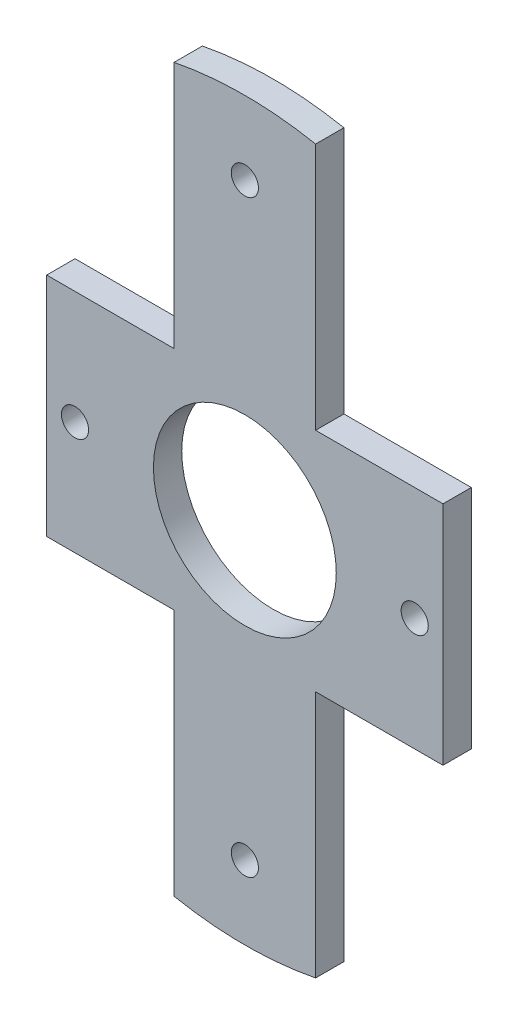
ISO-10303-21;
HEADER;
FILE_DESCRIPTION(('STEP AP214'),'2;1');
FILE_NAME('part.step','',(''),(''),'','','');
FILE_SCHEMA(('AUTOMOTIVE_DESIGN { 1 0 10303 214 1 1 1 1 }'));
ENDSEC;
DATA;
#1=APPLICATION_CONTEXT('core data for automotive mechanical design processes');
#2=APPLICATION_PROTOCOL_DEFINITION('international standard','automotive_design',2000,#1);
#3=PRODUCT_CONTEXT('',#1,'mechanical');
#4=PRODUCT('Part','Part','',(#3));
#5=PRODUCT_RELATED_PRODUCT_CATEGORY('part','',(#4));
#6=PRODUCT_DEFINITION_FORMATION('','',#4);
#7=PRODUCT_DEFINITION_CONTEXT('part definition',#1,'design');
#8=PRODUCT_DEFINITION('design','',#6,#7);
#9=PRODUCT_DEFINITION_SHAPE('','',#8);
#10=(LENGTH_UNIT() NAMED_UNIT(*) SI_UNIT(.MILLI.,.METRE.));
#11=(NAMED_UNIT(*) PLANE_ANGLE_UNIT() SI_UNIT($,.RADIAN.));
#12=(NAMED_UNIT(*) SI_UNIT($,.STERADIAN.) SOLID_ANGLE_UNIT());
#13=UNCERTAINTY_MEASURE_WITH_UNIT(LENGTH_MEASURE(1.E-05),#10,'distance_accuracy_value','');
#14=(GEOMETRIC_REPRESENTATION_CONTEXT(3) GLOBAL_UNCERTAINTY_ASSIGNED_CONTEXT((#13)) GLOBAL_UNIT_ASSIGNED_CONTEXT((#10,
#11,#12)) REPRESENTATION_CONTEXT('',''));
#15=CARTESIAN_POINT('',(0.,0.,0.));
#16=DIRECTION('',(0.,0.,1.));
#17=DIRECTION('',(1.,0.,0.));
#18=AXIS2_PLACEMENT_3D('',#15,#16,#17);
#19=CARTESIAN_POINT('',(0.,0.,5.));
#20=DIRECTION('',(0.,0.,1.));
#21=DIRECTION('',(1.,0.,0.));
#22=AXIS2_PLACEMENT_3D('',#19,#20,#21);
#23=PLANE('',#22);
#24=CARTESIAN_POINT('',(0.,-52.,5.));
#25=DIRECTION('',(0.,0.,1.));
#26=DIRECTION('',(-1.,0.,0.));
#27=AXIS2_PLACEMENT_3D('',#24,#25,#26);
#28=CIRCLE('',#27,2.4);
#29=CARTESIAN_POINT('',(-2.4,-52.,5.));
#30=VERTEX_POINT('',#29);
#31=EDGE_CURVE('E295',#30,#30,#28,.T.);
#32=ORIENTED_EDGE('',*,*,#31,.F.);
#33=EDGE_LOOP('',(#32));
#34=FACE_BOUND('',#33,.T.);
#35=CARTESIAN_POINT('',(0.,52.,5.));
#36=DIRECTION('',(0.,0.,1.));
#37=DIRECTION('',(1.,0.,0.));
#38=AXIS2_PLACEMENT_3D('',#35,#36,#37);
#39=CIRCLE('',#38,2.4);
#40=CARTESIAN_POINT('',(2.4,52.,5.));
#41=VERTEX_POINT('',#40);
#42=EDGE_CURVE('E307',#41,#41,#39,.T.);
#43=ORIENTED_EDGE('',*,*,#42,.F.);
#44=EDGE_LOOP('',(#43));
#45=FACE_BOUND('',#44,.T.);
#46=DIRECTION('',(0.,1.,0.));
#47=VECTOR('',#46,1.);
#48=CARTESIAN_POINT('',(12.5,20.,5.));
#49=LINE('',#48,#47);
#50=CARTESIAN_POINT('',(12.5,20.,5.));
#51=VERTEX_POINT('',#50);
#52=CARTESIAN_POINT('',(12.5,63.7867541108654,5.));
#53=VERTEX_POINT('',#52);
#54=EDGE_CURVE('E177',#51,#53,#49,.T.);
#55=ORIENTED_EDGE('',*,*,#54,.T.);
#56=CARTESIAN_POINT('',(0.,0.,5.));
#57=DIRECTION('',(0.,0.,1.));
#58=DIRECTION('',(1.,0.,0.));
#59=AXIS2_PLACEMENT_3D('',#56,#57,#58);
#60=CIRCLE('',#59,65.);
#61=CARTESIAN_POINT('',(-12.5,63.7867541108654,5.));
#62=VERTEX_POINT('',#61);
#63=EDGE_CURVE('E104',#53,#62,#60,.T.);
#64=ORIENTED_EDGE('',*,*,#63,.T.);
#65=DIRECTION('',(0.,-1.,0.));
#66=VECTOR('',#65,1.);
#67=CARTESIAN_POINT('',(-12.5,20.,5.));
#68=LINE('',#67,#66);
#69=CARTESIAN_POINT('',(-12.5,20.,5.));
#70=VERTEX_POINT('',#69);
#71=EDGE_CURVE('E204',#62,#70,#68,.T.);
#72=ORIENTED_EDGE('',*,*,#71,.T.);
#73=DIRECTION('',(-1.,0.,0.));
#74=VECTOR('',#73,1.);
#75=CARTESIAN_POINT('',(-12.5,20.,5.));
#76=LINE('',#75,#74);
#77=CARTESIAN_POINT('',(-35.,20.,5.));
#78=VERTEX_POINT('',#77);
#79=EDGE_CURVE('E223',#70,#78,#76,.T.);
#80=ORIENTED_EDGE('',*,*,#79,.T.);
#81=DIRECTION('',(0.,-1.,0.));
#82=VECTOR('',#81,1.);
#83=CARTESIAN_POINT('',(-35.,20.,5.));
#84=LINE('',#83,#82);
#85=CARTESIAN_POINT('',(-35.,-20.,5.));
#86=VERTEX_POINT('',#85);
#87=EDGE_CURVE('E220',#78,#86,#84,.T.);
#88=ORIENTED_EDGE('',*,*,#87,.T.);
#89=DIRECTION('',(1.,0.,0.));
#90=VECTOR('',#89,1.);
#91=CARTESIAN_POINT('',(-12.5,-20.,5.));
#92=LINE('',#91,#90);
#93=CARTESIAN_POINT('',(-12.5,-20.,5.));
#94=VERTEX_POINT('',#93);
#95=EDGE_CURVE('E222',#86,#94,#92,.T.);
#96=ORIENTED_EDGE('',*,*,#95,.T.);
#97=DIRECTION('',(0.,-1.,0.));
#98=VECTOR('',#97,1.);
#99=CARTESIAN_POINT('',(-12.5,-20.,5.));
#100=LINE('',#99,#98);
#101=CARTESIAN_POINT('',(-12.5,-63.7867541108654,5.));
#102=VERTEX_POINT('',#101);
#103=EDGE_CURVE('E225',#94,#102,#100,.T.);
#104=ORIENTED_EDGE('',*,*,#103,.T.);
#105=CARTESIAN_POINT('',(0.,0.,5.));
#106=DIRECTION('',(0.,0.,1.));
#107=DIRECTION('',(1.,0.,0.));
#108=AXIS2_PLACEMENT_3D('',#105,#106,#107);
#109=CIRCLE('',#108,65.);
#110=CARTESIAN_POINT('',(12.5,-63.7867541108654,5.));
#111=VERTEX_POINT('',#110);
#112=EDGE_CURVE('E231',#102,#111,#109,.T.);
#113=ORIENTED_EDGE('',*,*,#112,.T.);
#114=DIRECTION('',(0.,1.,0.));
#115=VECTOR('',#114,1.);
#116=CARTESIAN_POINT('',(12.5,-20.,5.));
#117=LINE('',#116,#115);
#118=CARTESIAN_POINT('',(12.5,-20.,5.));
#119=VERTEX_POINT('',#118);
#120=EDGE_CURVE('E135',#111,#119,#117,.T.);
#121=ORIENTED_EDGE('',*,*,#120,.T.);
#122=DIRECTION('',(1.,0.,0.));
#123=VECTOR('',#122,1.);
#124=CARTESIAN_POINT('',(12.5,-20.,5.));
#125=LINE('',#124,#123);
#126=CARTESIAN_POINT('',(35.,-20.,5.));
#127=VERTEX_POINT('',#126);
#128=EDGE_CURVE('E129',#119,#127,#125,.T.);
#129=ORIENTED_EDGE('',*,*,#128,.T.);
#130=DIRECTION('',(0.,1.,0.));
#131=VECTOR('',#130,1.);
#132=CARTESIAN_POINT('',(35.,-20.,5.));
#133=LINE('',#132,#131);
#134=CARTESIAN_POINT('',(35.,20.,5.));
#135=VERTEX_POINT('',#134);
#136=EDGE_CURVE('E133',#127,#135,#133,.T.);
#137=ORIENTED_EDGE('',*,*,#136,.T.);
#138=DIRECTION('',(-1.,0.,0.));
#139=VECTOR('',#138,1.);
#140=CARTESIAN_POINT('',(12.5,20.,5.));
#141=LINE('',#140,#139);
#142=EDGE_CURVE('E50',#135,#51,#141,.T.);
#143=ORIENTED_EDGE('',*,*,#142,.T.);
#144=EDGE_LOOP('',(#55,#64,#72,#80,#88,#96,#104,#113,#121,#129,#137,#143));
#145=FACE_BOUND('',#144,.T.);
#146=CARTESIAN_POINT('',(0.,0.,5.));
#147=DIRECTION('',(0.,0.,1.));
#148=DIRECTION('',(1.,0.,0.));
#149=AXIS2_PLACEMENT_3D('',#146,#147,#148);
#150=CIRCLE('',#149,16.15);
#151=CARTESIAN_POINT('',(16.15,0.,5.));
#152=VERTEX_POINT('',#151);
#153=EDGE_CURVE('E158',#152,#152,#150,.T.);
#154=ORIENTED_EDGE('',*,*,#153,.F.);
#155=EDGE_LOOP('',(#154));
#156=FACE_BOUND('',#155,.T.);
#157=CARTESIAN_POINT('',(30.,0.,5.));
#158=DIRECTION('',(0.,0.,1.));
#159=DIRECTION('',(1.,0.,0.));
#160=AXIS2_PLACEMENT_3D('',#157,#158,#159);
#161=CIRCLE('',#160,2.4);
#162=CARTESIAN_POINT('',(32.4,0.,5.));
#163=VERTEX_POINT('',#162);
#164=EDGE_CURVE('E301',#163,#163,#161,.T.);
#165=ORIENTED_EDGE('',*,*,#164,.F.);
#166=EDGE_LOOP('',(#165));
#167=FACE_BOUND('',#166,.T.);
#168=CARTESIAN_POINT('',(-30.,0.,5.));
#169=DIRECTION('',(0.,0.,1.));
#170=DIRECTION('',(-1.,0.,0.));
#171=AXIS2_PLACEMENT_3D('',#168,#169,#170);
#172=CIRCLE('',#171,2.4);
#173=CARTESIAN_POINT('',(-32.4,0.,5.));
#174=VERTEX_POINT('',#173);
#175=EDGE_CURVE('E286',#174,#174,#172,.T.);
#176=ORIENTED_EDGE('',*,*,#175,.F.);
#177=EDGE_LOOP('',(#176));
#178=FACE_BOUND('',#177,.T.);
#179=ADVANCED_FACE('F33',(#34,#45,#145,#156,#167,#178),#23,.T.);
#180=CARTESIAN_POINT('',(0.,0.,0.));
#181=DIRECTION('',(0.,0.,1.));
#182=DIRECTION('',(1.,0.,0.));
#183=AXIS2_PLACEMENT_3D('',#180,#181,#182);
#184=PLANE('',#183);
#185=DIRECTION('',(0.,1.,0.));
#186=VECTOR('',#185,1.);
#187=CARTESIAN_POINT('',(12.5,20.,0.));
#188=LINE('',#187,#186);
#189=CARTESIAN_POINT('',(12.5,20.,0.));
#190=VERTEX_POINT('',#189);
#191=CARTESIAN_POINT('',(12.5,63.7867541108654,0.));
#192=VERTEX_POINT('',#191);
#193=EDGE_CURVE('E154',#190,#192,#188,.T.);
#194=ORIENTED_EDGE('',*,*,#193,.F.);
#195=DIRECTION('',(-1.,0.,0.));
#196=VECTOR('',#195,1.);
#197=CARTESIAN_POINT('',(12.5,20.,0.));
#198=LINE('',#197,#196);
#199=CARTESIAN_POINT('',(35.,20.,0.));
#200=VERTEX_POINT('',#199);
#201=EDGE_CURVE('E96',#200,#190,#198,.T.);
#202=ORIENTED_EDGE('',*,*,#201,.F.);
#203=DIRECTION('',(0.,1.,0.));
#204=VECTOR('',#203,1.);
#205=CARTESIAN_POINT('',(35.,20.,0.));
#206=LINE('',#205,#204);
#207=CARTESIAN_POINT('',(35.,-20.,0.));
#208=VERTEX_POINT('',#207);
#209=EDGE_CURVE('E90',#208,#200,#206,.T.);
#210=ORIENTED_EDGE('',*,*,#209,.F.);
#211=DIRECTION('',(1.,0.,0.));
#212=VECTOR('',#211,1.);
#213=CARTESIAN_POINT('',(12.5,-20.,0.));
#214=LINE('',#213,#212);
#215=CARTESIAN_POINT('',(12.5,-20.,0.));
#216=VERTEX_POINT('',#215);
#217=EDGE_CURVE('E144',#216,#208,#214,.T.);
#218=ORIENTED_EDGE('',*,*,#217,.F.);
#219=DIRECTION('',(0.,1.,0.));
#220=VECTOR('',#219,1.);
#221=CARTESIAN_POINT('',(12.5,-20.,0.));
#222=LINE('',#221,#220);
#223=CARTESIAN_POINT('',(12.5,-63.7867541108654,0.));
#224=VERTEX_POINT('',#223);
#225=EDGE_CURVE('E172',#224,#216,#222,.T.);
#226=ORIENTED_EDGE('',*,*,#225,.F.);
#227=CARTESIAN_POINT('',(0.,0.,0.));
#228=DIRECTION('',(0.,0.,1.));
#229=DIRECTION('',(1.,0.,0.));
#230=AXIS2_PLACEMENT_3D('',#227,#228,#229);
#231=CIRCLE('',#230,65.);
#232=CARTESIAN_POINT('',(-12.5,-63.7867541108654,0.));
#233=VERTEX_POINT('',#232);
#234=EDGE_CURVE('E170',#233,#224,#231,.T.);
#235=ORIENTED_EDGE('',*,*,#234,.F.);
#236=DIRECTION('',(0.,-1.,0.));
#237=VECTOR('',#236,1.);
#238=CARTESIAN_POINT('',(-12.5,-20.,0.));
#239=LINE('',#238,#237);
#240=CARTESIAN_POINT('',(-12.5,-20.,0.));
#241=VERTEX_POINT('',#240);
#242=EDGE_CURVE('E168',#241,#233,#239,.T.);
#243=ORIENTED_EDGE('',*,*,#242,.F.);
#244=DIRECTION('',(1.,0.,0.));
#245=VECTOR('',#244,1.);
#246=CARTESIAN_POINT('',(-12.5,-20.,0.));
#247=LINE('',#246,#245);
#248=CARTESIAN_POINT('',(-35.,-20.,0.));
#249=VERTEX_POINT('',#248);
#250=EDGE_CURVE('E166',#249,#241,#247,.T.);
#251=ORIENTED_EDGE('',*,*,#250,.F.);
#252=DIRECTION('',(0.,-1.,0.));
#253=VECTOR('',#252,1.);
#254=CARTESIAN_POINT('',(-35.,20.,0.));
#255=LINE('',#254,#253);
#256=CARTESIAN_POINT('',(-35.,20.,0.));
#257=VERTEX_POINT('',#256);
#258=EDGE_CURVE('E164',#257,#249,#255,.T.);
#259=ORIENTED_EDGE('',*,*,#258,.F.);
#260=DIRECTION('',(-1.,0.,0.));
#261=VECTOR('',#260,1.);
#262=CARTESIAN_POINT('',(-12.5,20.,0.));
#263=LINE('',#262,#261);
#264=CARTESIAN_POINT('',(-12.5,20.,0.));
#265=VERTEX_POINT('',#264);
#266=EDGE_CURVE('E162',#265,#257,#263,.T.);
#267=ORIENTED_EDGE('',*,*,#266,.F.);
#268=DIRECTION('',(0.,-1.,0.));
#269=VECTOR('',#268,1.);
#270=CARTESIAN_POINT('',(-12.5,20.,0.));
#271=LINE('',#270,#269);
#272=CARTESIAN_POINT('',(-12.5,63.7867541108654,0.));
#273=VERTEX_POINT('',#272);
#274=EDGE_CURVE('E160',#273,#265,#271,.T.);
#275=ORIENTED_EDGE('',*,*,#274,.F.);
#276=CARTESIAN_POINT('',(0.,0.,0.));
#277=DIRECTION('',(0.,0.,1.));
#278=DIRECTION('',(1.,0.,0.));
#279=AXIS2_PLACEMENT_3D('',#276,#277,#278);
#280=CIRCLE('',#279,65.);
#281=EDGE_CURVE('E157',#192,#273,#280,.T.);
#282=ORIENTED_EDGE('',*,*,#281,.F.);
#283=EDGE_LOOP('',(#194,#202,#210,#218,#226,#235,#243,#251,#259,#267,#275,#282));
#284=FACE_BOUND('',#283,.T.);
#285=CARTESIAN_POINT('',(0.,0.,0.));
#286=DIRECTION('',(0.,0.,1.));
#287=DIRECTION('',(1.,0.,0.));
#288=AXIS2_PLACEMENT_3D('',#285,#286,#287);
#289=CIRCLE('',#288,16.15);
#290=CARTESIAN_POINT('',(16.15,0.,0.));
#291=VERTEX_POINT('',#290);
#292=EDGE_CURVE('E310',#291,#291,#289,.T.);
#293=ORIENTED_EDGE('',*,*,#292,.T.);
#294=EDGE_LOOP('',(#293));
#295=FACE_BOUND('',#294,.T.);
#296=CARTESIAN_POINT('',(0.,52.,0.));
#297=DIRECTION('',(0.,0.,1.));
#298=DIRECTION('',(1.,0.,0.));
#299=AXIS2_PLACEMENT_3D('',#296,#297,#298);
#300=CIRCLE('',#299,2.4);
#301=CARTESIAN_POINT('',(2.4,52.,0.));
#302=VERTEX_POINT('',#301);
#303=EDGE_CURVE('E304',#302,#302,#300,.T.);
#304=ORIENTED_EDGE('',*,*,#303,.T.);
#305=EDGE_LOOP('',(#304));
#306=FACE_BOUND('',#305,.T.);
#307=CARTESIAN_POINT('',(30.,0.,0.));
#308=DIRECTION('',(0.,0.,1.));
#309=DIRECTION('',(1.,0.,0.));
#310=AXIS2_PLACEMENT_3D('',#307,#308,#309);
#311=CIRCLE('',#310,2.4);
#312=CARTESIAN_POINT('',(32.4,0.,0.));
#313=VERTEX_POINT('',#312);
#314=EDGE_CURVE('E298',#313,#313,#311,.T.);
#315=ORIENTED_EDGE('',*,*,#314,.T.);
#316=EDGE_LOOP('',(#315));
#317=FACE_BOUND('',#316,.T.);
#318=CARTESIAN_POINT('',(0.,-52.,0.));
#319=DIRECTION('',(0.,0.,1.));
#320=DIRECTION('',(-1.,0.,0.));
#321=AXIS2_PLACEMENT_3D('',#318,#319,#320);
#322=CIRCLE('',#321,2.4);
#323=CARTESIAN_POINT('',(-2.4,-52.,0.));
#324=VERTEX_POINT('',#323);
#325=EDGE_CURVE('E292',#324,#324,#322,.T.);
#326=ORIENTED_EDGE('',*,*,#325,.T.);
#327=EDGE_LOOP('',(#326));
#328=FACE_BOUND('',#327,.T.);
#329=CARTESIAN_POINT('',(-30.,0.,0.));
#330=DIRECTION('',(0.,0.,1.));
#331=DIRECTION('',(-1.,0.,0.));
#332=AXIS2_PLACEMENT_3D('',#329,#330,#331);
#333=CIRCLE('',#332,2.4);
#334=CARTESIAN_POINT('',(-32.4,0.,0.));
#335=VERTEX_POINT('',#334);
#336=EDGE_CURVE('E289',#335,#335,#333,.T.);
#337=ORIENTED_EDGE('',*,*,#336,.T.);
#338=EDGE_LOOP('',(#337));
#339=FACE_BOUND('',#338,.T.);
#340=ADVANCED_FACE('F208',(#284,#295,#306,#317,#328,#339),#184,.F.);
#341=CARTESIAN_POINT('',(12.5,20.,5.));
#342=DIRECTION('',(-1.,0.,0.));
#343=DIRECTION('',(0.,0.,1.));
#344=AXIS2_PLACEMENT_3D('',#341,#342,#343);
#345=PLANE('',#344);
#346=ORIENTED_EDGE('',*,*,#193,.T.);
#347=DIRECTION('',(0.,0.,-1.));
#348=VECTOR('',#347,1.);
#349=CARTESIAN_POINT('',(12.5,63.7867541108654,5.));
#350=LINE('',#349,#348);
#351=EDGE_CURVE('E11',#53,#192,#350,.T.);
#352=ORIENTED_EDGE('',*,*,#351,.F.);
#353=ORIENTED_EDGE('',*,*,#54,.F.);
#354=DIRECTION('',(0.,0.,-1.));
#355=VECTOR('',#354,1.);
#356=CARTESIAN_POINT('',(12.5,20.,5.));
#357=LINE('',#356,#355);
#358=EDGE_CURVE('E150',#51,#190,#357,.T.);
#359=ORIENTED_EDGE('',*,*,#358,.T.);
#360=EDGE_LOOP('',(#346,#352,#353,#359));
#361=FACE_BOUND('',#360,.T.);
#362=ADVANCED_FACE('F35',(#361),#345,.F.);
#363=CARTESIAN_POINT('',(0.,0.,5.));
#364=DIRECTION('',(0.,0.,-1.));
#365=DIRECTION('',(-1.,0.,0.));
#366=AXIS2_PLACEMENT_3D('',#363,#364,#365);
#367=CYLINDRICAL_SURFACE('',#366,65.);
#368=ORIENTED_EDGE('',*,*,#281,.T.);
#369=DIRECTION('',(0.,0.,-1.));
#370=VECTOR('',#369,1.);
#371=CARTESIAN_POINT('',(-12.5,63.7867541108654,5.));
#372=LINE('',#371,#370);
#373=EDGE_CURVE('E42',#62,#273,#372,.T.);
#374=ORIENTED_EDGE('',*,*,#373,.F.);
#375=ORIENTED_EDGE('',*,*,#63,.F.);
#376=ORIENTED_EDGE('',*,*,#351,.T.);
#377=EDGE_LOOP('',(#368,#374,#375,#376));
#378=FACE_BOUND('',#377,.T.);
#379=ADVANCED_FACE('F430',(#378),#367,.T.);
#380=CARTESIAN_POINT('',(-12.5,20.,5.));
#381=DIRECTION('',(1.,0.,0.));
#382=DIRECTION('',(0.,0.,-1.));
#383=AXIS2_PLACEMENT_3D('',#380,#381,#382);
#384=PLANE('',#383);
#385=ORIENTED_EDGE('',*,*,#274,.T.);
#386=DIRECTION('',(0.,0.,-1.));
#387=VECTOR('',#386,1.);
#388=CARTESIAN_POINT('',(-12.5,20.,5.));
#389=LINE('',#388,#387);
#390=EDGE_CURVE('E196',#70,#265,#389,.T.);
#391=ORIENTED_EDGE('',*,*,#390,.F.);
#392=ORIENTED_EDGE('',*,*,#71,.F.);
#393=ORIENTED_EDGE('',*,*,#373,.T.);
#394=EDGE_LOOP('',(#385,#391,#392,#393));
#395=FACE_BOUND('',#394,.T.);
#396=ADVANCED_FACE('F202',(#395),#384,.F.);
#397=CARTESIAN_POINT('',(-12.5,20.,5.));
#398=DIRECTION('',(0.,-1.,0.));
#399=DIRECTION('',(0.,0.,-1.));
#400=AXIS2_PLACEMENT_3D('',#397,#398,#399);
#401=PLANE('',#400);
#402=ORIENTED_EDGE('',*,*,#266,.T.);
#403=DIRECTION('',(0.,0.,-1.));
#404=VECTOR('',#403,1.);
#405=CARTESIAN_POINT('',(-35.,20.,5.));
#406=LINE('',#405,#404);
#407=EDGE_CURVE('E193',#78,#257,#406,.T.);
#408=ORIENTED_EDGE('',*,*,#407,.F.);
#409=ORIENTED_EDGE('',*,*,#79,.F.);
#410=ORIENTED_EDGE('',*,*,#390,.T.);
#411=EDGE_LOOP('',(#402,#408,#409,#410));
#412=FACE_BOUND('',#411,.T.);
#413=ADVANCED_FACE('F214',(#412),#401,.F.);
#414=CARTESIAN_POINT('',(-35.,20.,5.));
#415=DIRECTION('',(1.,0.,0.));
#416=DIRECTION('',(0.,0.,-1.));
#417=AXIS2_PLACEMENT_3D('',#414,#415,#416);
#418=PLANE('',#417);
#419=ORIENTED_EDGE('',*,*,#258,.T.);
#420=DIRECTION('',(0.,0.,-1.));
#421=VECTOR('',#420,1.);
#422=CARTESIAN_POINT('',(-35.,-20.,5.));
#423=LINE('',#422,#421);
#424=EDGE_CURVE('E190',#86,#249,#423,.T.);
#425=ORIENTED_EDGE('',*,*,#424,.F.);
#426=ORIENTED_EDGE('',*,*,#87,.F.);
#427=ORIENTED_EDGE('',*,*,#407,.T.);
#428=EDGE_LOOP('',(#419,#425,#426,#427));
#429=FACE_BOUND('',#428,.T.);
#430=ADVANCED_FACE('F218',(#429),#418,.F.);
#431=CARTESIAN_POINT('',(-12.5,-20.,5.));
#432=DIRECTION('',(0.,1.,0.));
#433=DIRECTION('',(0.,0.,1.));
#434=AXIS2_PLACEMENT_3D('',#431,#432,#433);
#435=PLANE('',#434);
#436=ORIENTED_EDGE('',*,*,#250,.T.);
#437=DIRECTION('',(0.,0.,-1.));
#438=VECTOR('',#437,1.);
#439=CARTESIAN_POINT('',(-12.5,-20.,5.));
#440=LINE('',#439,#438);
#441=EDGE_CURVE('E187',#94,#241,#440,.T.);
#442=ORIENTED_EDGE('',*,*,#441,.F.);
#443=ORIENTED_EDGE('',*,*,#95,.F.);
#444=ORIENTED_EDGE('',*,*,#424,.T.);
#445=EDGE_LOOP('',(#436,#442,#443,#444));
#446=FACE_BOUND('',#445,.T.);
#447=ADVANCED_FACE('F395',(#446),#435,.F.);
#448=CARTESIAN_POINT('',(-12.5,-20.,5.));
#449=DIRECTION('',(1.,0.,0.));
#450=DIRECTION('',(0.,0.,-1.));
#451=AXIS2_PLACEMENT_3D('',#448,#449,#450);
#452=PLANE('',#451);
#453=ORIENTED_EDGE('',*,*,#242,.T.);
#454=DIRECTION('',(0.,0.,-1.));
#455=VECTOR('',#454,1.);
#456=CARTESIAN_POINT('',(-12.5,-63.7867541108654,5.));
#457=LINE('',#456,#455);
#458=EDGE_CURVE('E184',#102,#233,#457,.T.);
#459=ORIENTED_EDGE('',*,*,#458,.F.);
#460=ORIENTED_EDGE('',*,*,#103,.F.);
#461=ORIENTED_EDGE('',*,*,#441,.T.);
#462=EDGE_LOOP('',(#453,#459,#460,#461));
#463=FACE_BOUND('',#462,.T.);
#464=ADVANCED_FACE('F386',(#463),#452,.F.);
#465=CARTESIAN_POINT('',(0.,0.,5.));
#466=DIRECTION('',(0.,0.,-1.));
#467=DIRECTION('',(-1.,0.,0.));
#468=AXIS2_PLACEMENT_3D('',#465,#466,#467);
#469=CYLINDRICAL_SURFACE('',#468,65.);
#470=ORIENTED_EDGE('',*,*,#234,.T.);
#471=DIRECTION('',(0.,0.,-1.));
#472=VECTOR('',#471,1.);
#473=CARTESIAN_POINT('',(12.5,-63.7867541108654,5.));
#474=LINE('',#473,#472);
#475=EDGE_CURVE('E181',#111,#224,#474,.T.);
#476=ORIENTED_EDGE('',*,*,#475,.F.);
#477=ORIENTED_EDGE('',*,*,#112,.F.);
#478=ORIENTED_EDGE('',*,*,#458,.T.);
#479=EDGE_LOOP('',(#470,#476,#477,#478));
#480=FACE_BOUND('',#479,.T.);
#481=ADVANCED_FACE('F237',(#480),#469,.T.);
#482=CARTESIAN_POINT('',(12.5,-20.,5.));
#483=DIRECTION('',(-1.,0.,0.));
#484=DIRECTION('',(0.,0.,1.));
#485=AXIS2_PLACEMENT_3D('',#482,#483,#484);
#486=PLANE('',#485);
#487=ORIENTED_EDGE('',*,*,#225,.T.);
#488=DIRECTION('',(0.,0.,-1.));
#489=VECTOR('',#488,1.);
#490=CARTESIAN_POINT('',(12.5,-20.,5.));
#491=LINE('',#490,#489);
#492=EDGE_CURVE('E145',#119,#216,#491,.T.);
#493=ORIENTED_EDGE('',*,*,#492,.F.);
#494=ORIENTED_EDGE('',*,*,#120,.F.);
#495=ORIENTED_EDGE('',*,*,#475,.T.);
#496=EDGE_LOOP('',(#487,#493,#494,#495));
#497=FACE_BOUND('',#496,.T.);
#498=ADVANCED_FACE('F241',(#497),#486,.F.);
#499=CARTESIAN_POINT('',(12.5,-20.,5.));
#500=DIRECTION('',(0.,1.,0.));
#501=DIRECTION('',(0.,0.,1.));
#502=AXIS2_PLACEMENT_3D('',#499,#500,#501);
#503=PLANE('',#502);
#504=ORIENTED_EDGE('',*,*,#217,.T.);
#505=DIRECTION('',(0.,0.,-1.));
#506=VECTOR('',#505,1.);
#507=CARTESIAN_POINT('',(35.,-20.,5.));
#508=LINE('',#507,#506);
#509=EDGE_CURVE('E141',#127,#208,#508,.T.);
#510=ORIENTED_EDGE('',*,*,#509,.F.);
#511=ORIENTED_EDGE('',*,*,#128,.F.);
#512=ORIENTED_EDGE('',*,*,#492,.T.);
#513=EDGE_LOOP('',(#504,#510,#511,#512));
#514=FACE_BOUND('',#513,.T.);
#515=ADVANCED_FACE('F142',(#514),#503,.F.);
#516=CARTESIAN_POINT('',(35.,20.,5.));
#517=DIRECTION('',(-1.,0.,0.));
#518=DIRECTION('',(0.,-1.,0.));
#519=AXIS2_PLACEMENT_3D('',#516,#517,#518);
#520=PLANE('',#519);
#521=ORIENTED_EDGE('',*,*,#209,.T.);
#522=DIRECTION('',(0.,0.,-1.));
#523=VECTOR('',#522,1.);
#524=CARTESIAN_POINT('',(35.,20.,5.));
#525=LINE('',#524,#523);
#526=EDGE_CURVE('E146',#135,#200,#525,.T.);
#527=ORIENTED_EDGE('',*,*,#526,.F.);
#528=ORIENTED_EDGE('',*,*,#136,.F.);
#529=ORIENTED_EDGE('',*,*,#509,.T.);
#530=EDGE_LOOP('',(#521,#527,#528,#529));
#531=FACE_BOUND('',#530,.T.);
#532=ADVANCED_FACE('F148',(#531),#520,.F.);
#533=CARTESIAN_POINT('',(12.5,20.,5.));
#534=DIRECTION('',(0.,-1.,0.));
#535=DIRECTION('',(0.,0.,-1.));
#536=AXIS2_PLACEMENT_3D('',#533,#534,#535);
#537=PLANE('',#536);
#538=ORIENTED_EDGE('',*,*,#201,.T.);
#539=ORIENTED_EDGE('',*,*,#358,.F.);
#540=ORIENTED_EDGE('',*,*,#142,.F.);
#541=ORIENTED_EDGE('',*,*,#526,.T.);
#542=EDGE_LOOP('',(#538,#539,#540,#541));
#543=FACE_BOUND('',#542,.T.);
#544=ADVANCED_FACE('F245',(#543),#537,.F.);
#545=CARTESIAN_POINT('',(0.,0.,5.));
#546=DIRECTION('',(0.,0.,-1.));
#547=DIRECTION('',(-1.,0.,0.));
#548=AXIS2_PLACEMENT_3D('',#545,#546,#547);
#549=CYLINDRICAL_SURFACE('',#548,16.15);
#550=ORIENTED_EDGE('',*,*,#153,.T.);
#551=EDGE_LOOP('',(#550));
#552=FACE_BOUND('',#551,.T.);
#553=ORIENTED_EDGE('',*,*,#292,.F.);
#554=EDGE_LOOP('',(#553));
#555=FACE_BOUND('',#554,.T.);
#556=ADVANCED_FACE('F247',(#552,#555),#549,.F.);
#557=CARTESIAN_POINT('',(0.,52.,5.));
#558=DIRECTION('',(0.,0.,-1.));
#559=DIRECTION('',(-1.,0.,0.));
#560=AXIS2_PLACEMENT_3D('',#557,#558,#559);
#561=CYLINDRICAL_SURFACE('',#560,2.4);
#562=ORIENTED_EDGE('',*,*,#42,.T.);
#563=EDGE_LOOP('',(#562));
#564=FACE_BOUND('',#563,.T.);
#565=ORIENTED_EDGE('',*,*,#303,.F.);
#566=EDGE_LOOP('',(#565));
#567=FACE_BOUND('',#566,.T.);
#568=ADVANCED_FACE('F253',(#564,#567),#561,.F.);
#569=CARTESIAN_POINT('',(30.,0.,5.));
#570=DIRECTION('',(0.,0.,-1.));
#571=DIRECTION('',(-1.,0.,0.));
#572=AXIS2_PLACEMENT_3D('',#569,#570,#571);
#573=CYLINDRICAL_SURFACE('',#572,2.4);
#574=ORIENTED_EDGE('',*,*,#164,.T.);
#575=EDGE_LOOP('',(#574));
#576=FACE_BOUND('',#575,.T.);
#577=ORIENTED_EDGE('',*,*,#314,.F.);
#578=EDGE_LOOP('',(#577));
#579=FACE_BOUND('',#578,.T.);
#580=ADVANCED_FACE('F269',(#576,#579),#573,.F.);
#581=CARTESIAN_POINT('',(0.,-52.,5.));
#582=DIRECTION('',(0.,0.,-1.));
#583=DIRECTION('',(-1.,0.,0.));
#584=AXIS2_PLACEMENT_3D('',#581,#582,#583);
#585=CYLINDRICAL_SURFACE('',#584,2.4);
#586=ORIENTED_EDGE('',*,*,#31,.T.);
#587=EDGE_LOOP('',(#586));
#588=FACE_BOUND('',#587,.T.);
#589=ORIENTED_EDGE('',*,*,#325,.F.);
#590=EDGE_LOOP('',(#589));
#591=FACE_BOUND('',#590,.T.);
#592=ADVANCED_FACE('F273',(#588,#591),#585,.F.);
#593=CARTESIAN_POINT('',(-30.,0.,5.));
#594=DIRECTION('',(0.,0.,-1.));
#595=DIRECTION('',(-1.,0.,0.));
#596=AXIS2_PLACEMENT_3D('',#593,#594,#595);
#597=CYLINDRICAL_SURFACE('',#596,2.4);
#598=ORIENTED_EDGE('',*,*,#175,.T.);
#599=EDGE_LOOP('',(#598));
#600=FACE_BOUND('',#599,.T.);
#601=ORIENTED_EDGE('',*,*,#336,.F.);
#602=EDGE_LOOP('',(#601));
#603=FACE_BOUND('',#602,.T.);
#604=ADVANCED_FACE('F277',(#600,#603),#597,.F.);
#605=CLOSED_SHELL('',(#179,#340,#362,#379,#396,#413,#430,#447,#464,#481,#498,#515,#532,#544,
#556,#568,#580,#592,#604));
#606=MANIFOLD_SOLID_BREP('B2',#605);
#607=ADVANCED_BREP_SHAPE_REPRESENTATION('',(#18,#606),#14);
#608=SHAPE_DEFINITION_REPRESENTATION(#9,#607);
ENDSEC;
END-ISO-10303-21;
